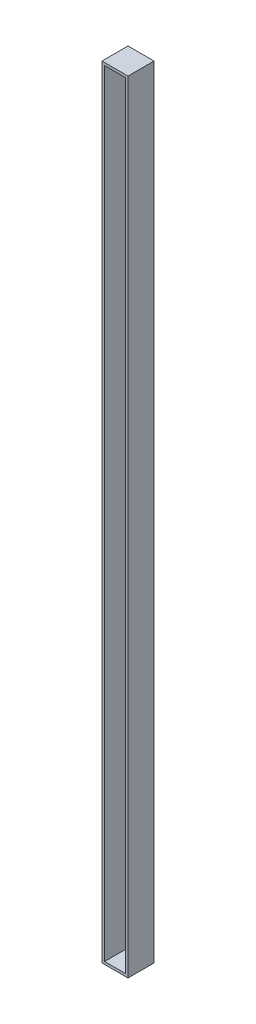
ISO-10303-21;
HEADER;
FILE_DESCRIPTION(('STEP AP214'),'2;1');
FILE_NAME('part.step','',(''),(''),'','','');
FILE_SCHEMA(('AUTOMOTIVE_DESIGN { 1 0 10303 214 1 1 1 1 }'));
ENDSEC;
DATA;
#1=APPLICATION_CONTEXT('core data for automotive mechanical design processes');
#2=APPLICATION_PROTOCOL_DEFINITION('international standard','automotive_design',2000,#1);
#3=PRODUCT_CONTEXT('',#1,'mechanical');
#4=PRODUCT('Part','Part','',(#3));
#5=PRODUCT_RELATED_PRODUCT_CATEGORY('part','',(#4));
#6=PRODUCT_DEFINITION_FORMATION('','',#4);
#7=PRODUCT_DEFINITION_CONTEXT('part definition',#1,'design');
#8=PRODUCT_DEFINITION('design','',#6,#7);
#9=PRODUCT_DEFINITION_SHAPE('','',#8);
#10=(LENGTH_UNIT() NAMED_UNIT(*) SI_UNIT(.MILLI.,.METRE.));
#11=(NAMED_UNIT(*) PLANE_ANGLE_UNIT() SI_UNIT($,.RADIAN.));
#12=(NAMED_UNIT(*) SI_UNIT($,.STERADIAN.) SOLID_ANGLE_UNIT());
#13=UNCERTAINTY_MEASURE_WITH_UNIT(LENGTH_MEASURE(1.E-05),#10,'distance_accuracy_value','');
#14=(GEOMETRIC_REPRESENTATION_CONTEXT(3) GLOBAL_UNCERTAINTY_ASSIGNED_CONTEXT((#13)) GLOBAL_UNIT_ASSIGNED_CONTEXT((#10,
#11,#12)) REPRESENTATION_CONTEXT('',''));
#15=CARTESIAN_POINT('',(0.,0.,0.));
#16=DIRECTION('',(0.,0.,1.));
#17=DIRECTION('',(1.,0.,0.));
#18=AXIS2_PLACEMENT_3D('',#15,#16,#17);
#19=CARTESIAN_POINT('',(-31.7391304347827,49.7826086956523,-20.));
#20=DIRECTION('',(-1.,0.,0.));
#21=DIRECTION('',(0.,-1.,0.));
#22=AXIS2_PLACEMENT_3D('',#19,#20,#21);
#23=PLANE('',#22);
#24=DIRECTION('',(0.,-1.,0.));
#25=VECTOR('',#24,1.);
#26=CARTESIAN_POINT('',(-31.7391304347827,49.7826086956523,0.));
#27=LINE('',#26,#25);
#28=CARTESIAN_POINT('',(-31.7391304347827,49.7826086956523,0.));
#29=VERTEX_POINT('',#28);
#30=CARTESIAN_POINT('',(-31.7391304347826,-550.217391304348,0.));
#31=VERTEX_POINT('',#30);
#32=EDGE_CURVE('E157',#29,#31,#27,.T.);
#33=ORIENTED_EDGE('',*,*,#32,.F.);
#34=DIRECTION('',(0.,0.,1.));
#35=VECTOR('',#34,1.);
#36=CARTESIAN_POINT('',(-31.7391304347827,49.7826086956523,-20.));
#37=LINE('',#36,#35);
#38=CARTESIAN_POINT('',(-31.7391304347827,49.7826086956523,-20.));
#39=VERTEX_POINT('',#38);
#40=EDGE_CURVE('E11',#39,#29,#37,.T.);
#41=ORIENTED_EDGE('',*,*,#40,.F.);
#42=DIRECTION('',(0.,-1.,0.));
#43=VECTOR('',#42,1.);
#44=CARTESIAN_POINT('',(-31.7391304347827,49.7826086956523,-20.));
#45=LINE('',#44,#43);
#46=CARTESIAN_POINT('',(-31.7391304347826,-550.217391304348,-20.));
#47=VERTEX_POINT('',#46);
#48=EDGE_CURVE('E163',#39,#47,#45,.T.);
#49=ORIENTED_EDGE('',*,*,#48,.T.);
#50=DIRECTION('',(0.,0.,1.));
#51=VECTOR('',#50,1.);
#52=CARTESIAN_POINT('',(-31.7391304347826,-550.217391304348,-20.));
#53=LINE('',#52,#51);
#54=EDGE_CURVE('E42',#47,#31,#53,.T.);
#55=ORIENTED_EDGE('',*,*,#54,.T.);
#56=EDGE_LOOP('',(#33,#41,#49,#55));
#57=FACE_BOUND('',#56,.T.);
#58=ADVANCED_FACE('F39',(#57),#23,.T.);
#59=CARTESIAN_POINT('',(-31.7391304347827,49.7826086956523,-20.));
#60=DIRECTION('',(0.,1.,0.));
#61=DIRECTION('',(0.,0.,1.));
#62=AXIS2_PLACEMENT_3D('',#59,#60,#61);
#63=PLANE('',#62);
#64=DIRECTION('',(-1.,0.,0.));
#65=VECTOR('',#64,1.);
#66=CARTESIAN_POINT('',(-31.7391304347827,49.7826086956523,0.));
#67=LINE('',#66,#65);
#68=CARTESIAN_POINT('',(-11.7391304347827,49.7826086956523,0.));
#69=VERTEX_POINT('',#68);
#70=EDGE_CURVE('E167',#69,#29,#67,.T.);
#71=ORIENTED_EDGE('',*,*,#70,.F.);
#72=DIRECTION('',(0.,0.,1.));
#73=VECTOR('',#72,1.);
#74=CARTESIAN_POINT('',(-11.7391304347827,49.7826086956523,-20.));
#75=LINE('',#74,#73);
#76=CARTESIAN_POINT('',(-11.7391304347827,49.7826086956523,-20.));
#77=VERTEX_POINT('',#76);
#78=EDGE_CURVE('E48',#77,#69,#75,.T.);
#79=ORIENTED_EDGE('',*,*,#78,.F.);
#80=DIRECTION('',(-1.,0.,0.));
#81=VECTOR('',#80,1.);
#82=CARTESIAN_POINT('',(-31.7391304347827,49.7826086956523,-20.));
#83=LINE('',#82,#81);
#84=EDGE_CURVE('E174',#77,#39,#83,.T.);
#85=ORIENTED_EDGE('',*,*,#84,.T.);
#86=ORIENTED_EDGE('',*,*,#40,.T.);
#87=EDGE_LOOP('',(#71,#79,#85,#86));
#88=FACE_BOUND('',#87,.T.);
#89=ADVANCED_FACE('F199',(#88),#63,.T.);
#90=CARTESIAN_POINT('',(-11.7391304347827,49.7826086956523,-20.));
#91=DIRECTION('',(1.,0.,0.));
#92=DIRECTION('',(0.,1.,0.));
#93=AXIS2_PLACEMENT_3D('',#90,#91,#92);
#94=PLANE('',#93);
#95=DIRECTION('',(0.,1.,0.));
#96=VECTOR('',#95,1.);
#97=CARTESIAN_POINT('',(-11.7391304347827,49.7826086956523,0.));
#98=LINE('',#97,#96);
#99=CARTESIAN_POINT('',(-11.7391304347826,-550.217391304348,0.));
#100=VERTEX_POINT('',#99);
#101=EDGE_CURVE('E184',#100,#69,#98,.T.);
#102=ORIENTED_EDGE('',*,*,#101,.F.);
#103=DIRECTION('',(0.,0.,1.));
#104=VECTOR('',#103,1.);
#105=CARTESIAN_POINT('',(-11.7391304347826,-550.217391304348,-20.));
#106=LINE('',#105,#104);
#107=CARTESIAN_POINT('',(-11.7391304347826,-550.217391304348,-20.));
#108=VERTEX_POINT('',#107);
#109=EDGE_CURVE('E192',#108,#100,#106,.T.);
#110=ORIENTED_EDGE('',*,*,#109,.F.);
#111=DIRECTION('',(0.,1.,0.));
#112=VECTOR('',#111,1.);
#113=CARTESIAN_POINT('',(-11.7391304347827,49.7826086956523,-20.));
#114=LINE('',#113,#112);
#115=EDGE_CURVE('E170',#108,#77,#114,.T.);
#116=ORIENTED_EDGE('',*,*,#115,.T.);
#117=ORIENTED_EDGE('',*,*,#78,.T.);
#118=EDGE_LOOP('',(#102,#110,#116,#117));
#119=FACE_BOUND('',#118,.T.);
#120=ADVANCED_FACE('F203',(#119),#94,.T.);
#121=CARTESIAN_POINT('',(-31.7391304347826,-550.217391304348,-20.));
#122=DIRECTION('',(0.,-1.,0.));
#123=DIRECTION('',(0.,0.,-1.));
#124=AXIS2_PLACEMENT_3D('',#121,#122,#123);
#125=PLANE('',#124);
#126=DIRECTION('',(1.,0.,0.));
#127=VECTOR('',#126,1.);
#128=CARTESIAN_POINT('',(-31.7391304347826,-550.217391304348,0.));
#129=LINE('',#128,#127);
#130=EDGE_CURVE('E180',#31,#100,#129,.T.);
#131=ORIENTED_EDGE('',*,*,#130,.F.);
#132=ORIENTED_EDGE('',*,*,#54,.F.);
#133=DIRECTION('',(1.,0.,0.));
#134=VECTOR('',#133,1.);
#135=CARTESIAN_POINT('',(-31.7391304347826,-550.217391304348,-20.));
#136=LINE('',#135,#134);
#137=EDGE_CURVE('E166',#47,#108,#136,.T.);
#138=ORIENTED_EDGE('',*,*,#137,.T.);
#139=ORIENTED_EDGE('',*,*,#109,.T.);
#140=EDGE_LOOP('',(#131,#132,#138,#139));
#141=FACE_BOUND('',#140,.T.);
#142=ADVANCED_FACE('F196',(#141),#125,.T.);
#143=CARTESIAN_POINT('',(0.,0.,-20.));
#144=DIRECTION('',(0.,0.,1.));
#145=DIRECTION('',(1.,0.,0.));
#146=AXIS2_PLACEMENT_3D('',#143,#144,#145);
#147=PLANE('',#146);
#148=ORIENTED_EDGE('',*,*,#48,.F.);
#149=ORIENTED_EDGE('',*,*,#84,.F.);
#150=ORIENTED_EDGE('',*,*,#115,.F.);
#151=ORIENTED_EDGE('',*,*,#137,.F.);
#152=EDGE_LOOP('',(#148,#149,#150,#151));
#153=FACE_BOUND('',#152,.T.);
#154=ADVANCED_FACE('F205',(#153),#147,.F.);
#155=CARTESIAN_POINT('',(0.,0.,0.));
#156=DIRECTION('',(0.,0.,1.));
#157=DIRECTION('',(1.,0.,0.));
#158=AXIS2_PLACEMENT_3D('',#155,#156,#157);
#159=PLANE('',#158);
#160=DIRECTION('',(-1.,0.,0.));
#161=VECTOR('',#160,1.);
#162=CARTESIAN_POINT('',(-13.7391304347827,47.7826086956523,0.));
#163=LINE('',#162,#161);
#164=CARTESIAN_POINT('',(-13.7391304347827,47.7826086956523,0.));
#165=VERTEX_POINT('',#164);
#166=CARTESIAN_POINT('',(-29.7391304347827,47.7826086956523,0.));
#167=VERTEX_POINT('',#166);
#168=EDGE_CURVE('E56',#165,#167,#163,.T.);
#169=ORIENTED_EDGE('',*,*,#168,.F.);
#170=DIRECTION('',(0.,1.,0.));
#171=VECTOR('',#170,1.);
#172=CARTESIAN_POINT('',(-13.7391304347826,-548.217391304348,0.));
#173=LINE('',#172,#171);
#174=CARTESIAN_POINT('',(-13.7391304347826,-548.217391304348,0.));
#175=VERTEX_POINT('',#174);
#176=EDGE_CURVE('E135',#175,#165,#173,.T.);
#177=ORIENTED_EDGE('',*,*,#176,.F.);
#178=DIRECTION('',(1.,0.,0.));
#179=VECTOR('',#178,1.);
#180=CARTESIAN_POINT('',(-29.7391304347826,-548.217391304348,0.));
#181=LINE('',#180,#179);
#182=CARTESIAN_POINT('',(-29.7391304347826,-548.217391304348,0.));
#183=VERTEX_POINT('',#182);
#184=EDGE_CURVE('E139',#183,#175,#181,.T.);
#185=ORIENTED_EDGE('',*,*,#184,.F.);
#186=DIRECTION('',(0.,-1.,0.));
#187=VECTOR('',#186,1.);
#188=CARTESIAN_POINT('',(-29.7391304347827,47.7826086956523,0.));
#189=LINE('',#188,#187);
#190=EDGE_CURVE('E148',#167,#183,#189,.T.);
#191=ORIENTED_EDGE('',*,*,#190,.F.);
#192=EDGE_LOOP('',(#169,#177,#185,#191));
#193=FACE_BOUND('',#192,.T.);
#194=ORIENTED_EDGE('',*,*,#32,.T.);
#195=ORIENTED_EDGE('',*,*,#130,.T.);
#196=ORIENTED_EDGE('',*,*,#101,.T.);
#197=ORIENTED_EDGE('',*,*,#70,.T.);
#198=EDGE_LOOP('',(#194,#195,#196,#197));
#199=FACE_BOUND('',#198,.T.);
#200=ADVANCED_FACE('F198',(#193,#199),#159,.T.);
#201=CARTESIAN_POINT('',(-13.7391304347827,47.7826086956523,-18.));
#202=DIRECTION('',(0.,1.,0.));
#203=DIRECTION('',(0.,0.,1.));
#204=AXIS2_PLACEMENT_3D('',#201,#202,#203);
#205=PLANE('',#204);
#206=ORIENTED_EDGE('',*,*,#168,.T.);
#207=DIRECTION('',(0.,0.,1.));
#208=VECTOR('',#207,1.);
#209=CARTESIAN_POINT('',(-29.7391304347827,47.7826086956523,-18.));
#210=LINE('',#209,#208);
#211=CARTESIAN_POINT('',(-29.7391304347827,47.7826086956523,-18.));
#212=VERTEX_POINT('',#211);
#213=EDGE_CURVE('E110',#212,#167,#210,.T.);
#214=ORIENTED_EDGE('',*,*,#213,.F.);
#215=DIRECTION('',(-1.,0.,0.));
#216=VECTOR('',#215,1.);
#217=CARTESIAN_POINT('',(-13.7391304347827,47.7826086956523,-18.));
#218=LINE('',#217,#216);
#219=CARTESIAN_POINT('',(-13.7391304347827,47.7826086956523,-18.));
#220=VERTEX_POINT('',#219);
#221=EDGE_CURVE('E114',#220,#212,#218,.T.);
#222=ORIENTED_EDGE('',*,*,#221,.F.);
#223=DIRECTION('',(0.,0.,1.));
#224=VECTOR('',#223,1.);
#225=CARTESIAN_POINT('',(-13.7391304347827,47.7826086956523,-18.));
#226=LINE('',#225,#224);
#227=EDGE_CURVE('E154',#220,#165,#226,.T.);
#228=ORIENTED_EDGE('',*,*,#227,.T.);
#229=EDGE_LOOP('',(#206,#214,#222,#228));
#230=FACE_BOUND('',#229,.T.);
#231=ADVANCED_FACE('F112',(#230),#205,.F.);
#232=CARTESIAN_POINT('',(-13.7391304347826,-548.217391304348,-18.));
#233=DIRECTION('',(1.,0.,0.));
#234=DIRECTION('',(0.,1.,0.));
#235=AXIS2_PLACEMENT_3D('',#232,#233,#234);
#236=PLANE('',#235);
#237=ORIENTED_EDGE('',*,*,#176,.T.);
#238=ORIENTED_EDGE('',*,*,#227,.F.);
#239=DIRECTION('',(0.,1.,0.));
#240=VECTOR('',#239,1.);
#241=CARTESIAN_POINT('',(-13.7391304347826,-548.217391304348,-18.));
#242=LINE('',#241,#240);
#243=CARTESIAN_POINT('',(-13.7391304347826,-548.217391304348,-18.));
#244=VERTEX_POINT('',#243);
#245=EDGE_CURVE('E121',#244,#220,#242,.T.);
#246=ORIENTED_EDGE('',*,*,#245,.F.);
#247=DIRECTION('',(0.,0.,1.));
#248=VECTOR('',#247,1.);
#249=CARTESIAN_POINT('',(-13.7391304347826,-548.217391304348,-18.));
#250=LINE('',#249,#248);
#251=EDGE_CURVE('E158',#244,#175,#250,.T.);
#252=ORIENTED_EDGE('',*,*,#251,.T.);
#253=EDGE_LOOP('',(#237,#238,#246,#252));
#254=FACE_BOUND('',#253,.T.);
#255=ADVANCED_FACE('F249',(#254),#236,.F.);
#256=CARTESIAN_POINT('',(-29.7391304347826,-548.217391304348,-18.));
#257=DIRECTION('',(0.,-1.,0.));
#258=DIRECTION('',(0.,0.,-1.));
#259=AXIS2_PLACEMENT_3D('',#256,#257,#258);
#260=PLANE('',#259);
#261=ORIENTED_EDGE('',*,*,#184,.T.);
#262=ORIENTED_EDGE('',*,*,#251,.F.);
#263=DIRECTION('',(1.,0.,0.));
#264=VECTOR('',#263,1.);
#265=CARTESIAN_POINT('',(-29.7391304347826,-548.217391304348,-18.));
#266=LINE('',#265,#264);
#267=CARTESIAN_POINT('',(-29.7391304347826,-548.217391304348,-18.));
#268=VERTEX_POINT('',#267);
#269=EDGE_CURVE('E130',#268,#244,#266,.T.);
#270=ORIENTED_EDGE('',*,*,#269,.F.);
#271=DIRECTION('',(0.,0.,1.));
#272=VECTOR('',#271,1.);
#273=CARTESIAN_POINT('',(-29.7391304347826,-548.217391304348,-18.));
#274=LINE('',#273,#272);
#275=EDGE_CURVE('E120',#268,#183,#274,.T.);
#276=ORIENTED_EDGE('',*,*,#275,.T.);
#277=EDGE_LOOP('',(#261,#262,#270,#276));
#278=FACE_BOUND('',#277,.T.);
#279=ADVANCED_FACE('F257',(#278),#260,.F.);
#280=CARTESIAN_POINT('',(-29.7391304347827,47.7826086956523,-18.));
#281=DIRECTION('',(-1.,0.,0.));
#282=DIRECTION('',(0.,-1.,0.));
#283=AXIS2_PLACEMENT_3D('',#280,#281,#282);
#284=PLANE('',#283);
#285=ORIENTED_EDGE('',*,*,#190,.T.);
#286=ORIENTED_EDGE('',*,*,#275,.F.);
#287=DIRECTION('',(0.,-1.,0.));
#288=VECTOR('',#287,1.);
#289=CARTESIAN_POINT('',(-29.7391304347827,47.7826086956523,-18.));
#290=LINE('',#289,#288);
#291=EDGE_CURVE('E124',#212,#268,#290,.T.);
#292=ORIENTED_EDGE('',*,*,#291,.F.);
#293=ORIENTED_EDGE('',*,*,#213,.T.);
#294=EDGE_LOOP('',(#285,#286,#292,#293));
#295=FACE_BOUND('',#294,.T.);
#296=ADVANCED_FACE('F125',(#295),#284,.F.);
#297=CARTESIAN_POINT('',(0.,0.,-18.));
#298=DIRECTION('',(0.,0.,1.));
#299=DIRECTION('',(1.,0.,0.));
#300=AXIS2_PLACEMENT_3D('',#297,#298,#299);
#301=PLANE('',#300);
#302=ORIENTED_EDGE('',*,*,#221,.T.);
#303=ORIENTED_EDGE('',*,*,#291,.T.);
#304=ORIENTED_EDGE('',*,*,#269,.T.);
#305=ORIENTED_EDGE('',*,*,#245,.T.);
#306=EDGE_LOOP('',(#302,#303,#304,#305));
#307=FACE_BOUND('',#306,.T.);
#308=ADVANCED_FACE('F132',(#307),#301,.T.);
#309=CLOSED_SHELL('',(#58,#89,#120,#142,#154,#200,#231,#255,#279,#296,#308));
#310=MANIFOLD_SOLID_BREP('B2',#309);
#311=ADVANCED_BREP_SHAPE_REPRESENTATION('',(#18,#310),#14);
#312=SHAPE_DEFINITION_REPRESENTATION(#9,#311);
ENDSEC;
END-ISO-10303-21;
